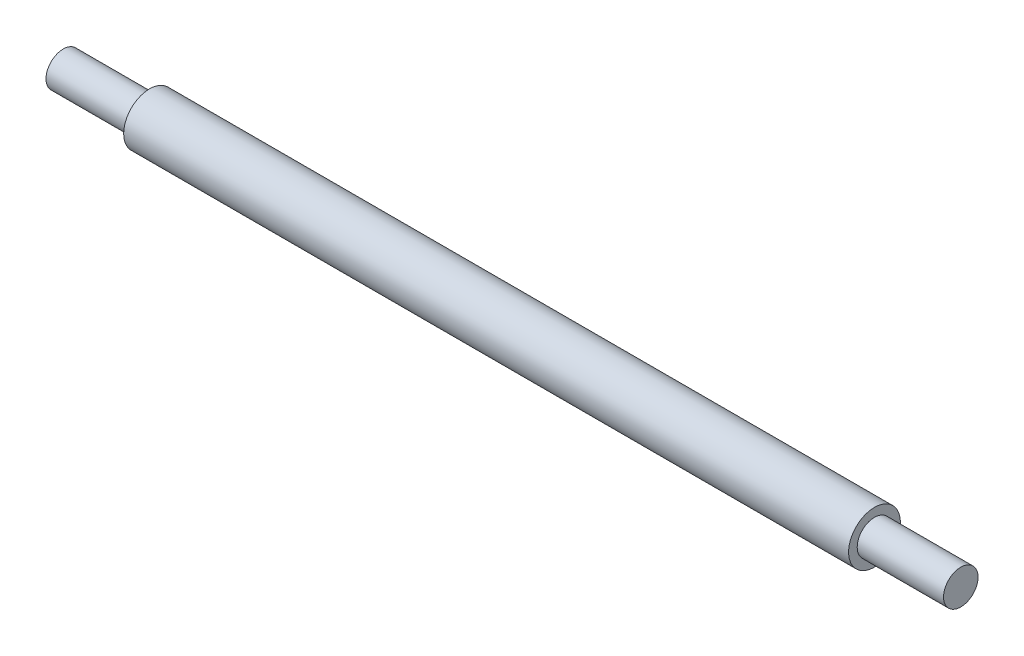
ISO-10303-21;
HEADER;
FILE_DESCRIPTION(('STEP AP214'),'2;1');
FILE_NAME('part.step','',(''),(''),'','','');
FILE_SCHEMA(('AUTOMOTIVE_DESIGN { 1 0 10303 214 1 1 1 1 }'));
ENDSEC;
DATA;
#1=APPLICATION_CONTEXT('core data for automotive mechanical design processes');
#2=APPLICATION_PROTOCOL_DEFINITION('international standard','automotive_design',2000,#1);
#3=PRODUCT_CONTEXT('',#1,'mechanical');
#4=PRODUCT('Part','Part','',(#3));
#5=PRODUCT_RELATED_PRODUCT_CATEGORY('part','',(#4));
#6=PRODUCT_DEFINITION_FORMATION('','',#4);
#7=PRODUCT_DEFINITION_CONTEXT('part definition',#1,'design');
#8=PRODUCT_DEFINITION('design','',#6,#7);
#9=PRODUCT_DEFINITION_SHAPE('','',#8);
#10=(LENGTH_UNIT() NAMED_UNIT(*) SI_UNIT(.MILLI.,.METRE.));
#11=(NAMED_UNIT(*) PLANE_ANGLE_UNIT() SI_UNIT($,.RADIAN.));
#12=(NAMED_UNIT(*) SI_UNIT($,.STERADIAN.) SOLID_ANGLE_UNIT());
#13=UNCERTAINTY_MEASURE_WITH_UNIT(LENGTH_MEASURE(1.E-05),#10,'distance_accuracy_value','');
#14=(GEOMETRIC_REPRESENTATION_CONTEXT(3) GLOBAL_UNCERTAINTY_ASSIGNED_CONTEXT((#13)) GLOBAL_UNIT_ASSIGNED_CONTEXT((#10,
#11,#12)) REPRESENTATION_CONTEXT('',''));
#15=CARTESIAN_POINT('',(0.,0.,0.));
#16=DIRECTION('',(0.,0.,1.));
#17=DIRECTION('',(1.,0.,0.));
#18=AXIS2_PLACEMENT_3D('',#15,#16,#17);
#19=CARTESIAN_POINT('',(0.,0.,0.));
#20=DIRECTION('',(-1.,0.,0.));
#21=DIRECTION('',(0.,0.,1.));
#22=AXIS2_PLACEMENT_3D('',#19,#20,#21);
#23=PLANE('',#22);
#24=CARTESIAN_POINT('',(0.,0.,0.));
#25=DIRECTION('',(-1.,0.,0.));
#26=DIRECTION('',(0.,0.,1.));
#27=AXIS2_PLACEMENT_3D('',#24,#25,#26);
#28=CIRCLE('',#27,2.);
#29=CARTESIAN_POINT('',(0.,0.,2.));
#30=VERTEX_POINT('',#29);
#31=EDGE_CURVE('E55',#30,#30,#28,.T.);
#32=ORIENTED_EDGE('',*,*,#31,.T.);
#33=EDGE_LOOP('',(#32));
#34=FACE_BOUND('',#33,.T.);
#35=ADVANCED_FACE('F33',(#34),#23,.T.);
#36=CARTESIAN_POINT('',(104.,0.,0.));
#37=DIRECTION('',(1.,0.,0.));
#38=DIRECTION('',(0.,0.,-1.));
#39=AXIS2_PLACEMENT_3D('',#36,#37,#38);
#40=PLANE('',#39);
#41=CARTESIAN_POINT('',(104.,0.,0.));
#42=DIRECTION('',(-1.,0.,0.));
#43=DIRECTION('',(0.,0.,1.));
#44=AXIS2_PLACEMENT_3D('',#41,#42,#43);
#45=CIRCLE('',#44,2.);
#46=CARTESIAN_POINT('',(104.,0.,2.));
#47=VERTEX_POINT('',#46);
#48=EDGE_CURVE('E10',#47,#47,#45,.T.);
#49=ORIENTED_EDGE('',*,*,#48,.F.);
#50=EDGE_LOOP('',(#49));
#51=FACE_BOUND('',#50,.T.);
#52=ADVANCED_FACE('F72',(#51),#40,.T.);
#53=CARTESIAN_POINT('',(-71.6876061120543,0.,0.));
#54=DIRECTION('',(-1.,0.,0.));
#55=DIRECTION('',(0.,0.,1.));
#56=AXIS2_PLACEMENT_3D('',#53,#54,#55);
#57=CYLINDRICAL_SURFACE('',#56,2.);
#58=ORIENTED_EDGE('',*,*,#48,.T.);
#59=EDGE_LOOP('',(#58));
#60=FACE_BOUND('',#59,.T.);
#61=CARTESIAN_POINT('',(94.,0.,0.));
#62=DIRECTION('',(-1.,0.,0.));
#63=DIRECTION('',(0.,0.,1.));
#64=AXIS2_PLACEMENT_3D('',#61,#62,#63);
#65=CIRCLE('',#64,2.);
#66=CARTESIAN_POINT('',(94.,0.,2.));
#67=VERTEX_POINT('',#66);
#68=EDGE_CURVE('E39',#67,#67,#65,.T.);
#69=ORIENTED_EDGE('',*,*,#68,.F.);
#70=EDGE_LOOP('',(#69));
#71=FACE_BOUND('',#70,.T.);
#72=ADVANCED_FACE('F76',(#60,#71),#57,.T.);
#73=CARTESIAN_POINT('',(94.,-1.30451205393456E-12,0.));
#74=DIRECTION('',(1.,0.,0.));
#75=DIRECTION('',(0.,0.,-1.));
#76=AXIS2_PLACEMENT_3D('',#73,#74,#75);
#77=PLANE('',#76);
#78=ORIENTED_EDGE('',*,*,#68,.T.);
#79=EDGE_LOOP('',(#78));
#80=FACE_BOUND('',#79,.T.);
#81=CARTESIAN_POINT('',(94.,0.,0.));
#82=DIRECTION('',(-1.,0.,0.));
#83=DIRECTION('',(0.,0.,1.));
#84=AXIS2_PLACEMENT_3D('',#81,#82,#83);
#85=CIRCLE('',#84,3.);
#86=CARTESIAN_POINT('',(94.,0.,3.));
#87=VERTEX_POINT('',#86);
#88=EDGE_CURVE('E43',#87,#87,#85,.T.);
#89=ORIENTED_EDGE('',*,*,#88,.F.);
#90=EDGE_LOOP('',(#89));
#91=FACE_BOUND('',#90,.T.);
#92=ADVANCED_FACE('F81',(#80,#91),#77,.T.);
#93=CARTESIAN_POINT('',(-71.6876061120543,0.,0.));
#94=DIRECTION('',(-1.,0.,0.));
#95=DIRECTION('',(0.,0.,1.));
#96=AXIS2_PLACEMENT_3D('',#93,#94,#95);
#97=CYLINDRICAL_SURFACE('',#96,3.);
#98=ORIENTED_EDGE('',*,*,#88,.T.);
#99=EDGE_LOOP('',(#98));
#100=FACE_BOUND('',#99,.T.);
#101=CARTESIAN_POINT('',(9.99999999999999,0.,0.));
#102=DIRECTION('',(-1.,0.,0.));
#103=DIRECTION('',(0.,0.,1.));
#104=AXIS2_PLACEMENT_3D('',#101,#102,#103);
#105=CIRCLE('',#104,3.);
#106=CARTESIAN_POINT('',(9.99999999999999,0.,3.));
#107=VERTEX_POINT('',#106);
#108=EDGE_CURVE('E47',#107,#107,#105,.T.);
#109=ORIENTED_EDGE('',*,*,#108,.F.);
#110=EDGE_LOOP('',(#109));
#111=FACE_BOUND('',#110,.T.);
#112=ADVANCED_FACE('F68',(#100,#111),#97,.T.);
#113=CARTESIAN_POINT('',(10.,0.,0.));
#114=DIRECTION('',(1.,0.,0.));
#115=DIRECTION('',(0.,0.,-1.));
#116=AXIS2_PLACEMENT_3D('',#113,#114,#115);
#117=PLANE('',#116);
#118=CARTESIAN_POINT('',(9.99999999999999,0.,0.));
#119=DIRECTION('',(-1.,0.,0.));
#120=DIRECTION('',(0.,0.,1.));
#121=AXIS2_PLACEMENT_3D('',#118,#119,#120);
#122=CIRCLE('',#121,2.);
#123=CARTESIAN_POINT('',(9.99999999999999,0.,2.));
#124=VERTEX_POINT('',#123);
#125=EDGE_CURVE('E52',#124,#124,#122,.T.);
#126=ORIENTED_EDGE('',*,*,#125,.F.);
#127=EDGE_LOOP('',(#126));
#128=FACE_BOUND('',#127,.T.);
#129=ORIENTED_EDGE('',*,*,#108,.T.);
#130=EDGE_LOOP('',(#129));
#131=FACE_BOUND('',#130,.T.);
#132=ADVANCED_FACE('F62',(#128,#131),#117,.F.);
#133=CARTESIAN_POINT('',(-71.6876061120543,0.,0.));
#134=DIRECTION('',(-1.,0.,0.));
#135=DIRECTION('',(0.,0.,1.));
#136=AXIS2_PLACEMENT_3D('',#133,#134,#135);
#137=CYLINDRICAL_SURFACE('',#136,2.);
#138=ORIENTED_EDGE('',*,*,#125,.T.);
#139=EDGE_LOOP('',(#138));
#140=FACE_BOUND('',#139,.T.);
#141=ORIENTED_EDGE('',*,*,#31,.F.);
#142=EDGE_LOOP('',(#141));
#143=FACE_BOUND('',#142,.T.);
#144=ADVANCED_FACE('F60',(#140,#143),#137,.T.);
#145=CLOSED_SHELL('',(#35,#52,#72,#92,#112,#132,#144));
#146=MANIFOLD_SOLID_BREP('B2',#145);
#147=ADVANCED_BREP_SHAPE_REPRESENTATION('',(#18,#146),#14);
#148=SHAPE_DEFINITION_REPRESENTATION(#9,#147);
ENDSEC;
END-ISO-10303-21;
